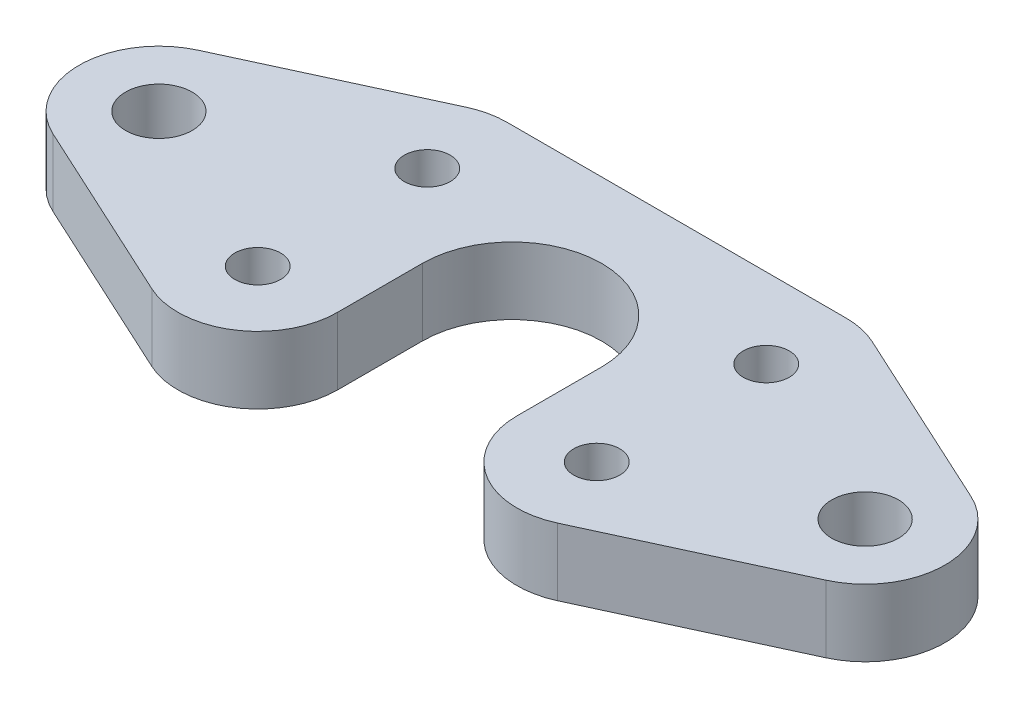
ISO-10303-21;
HEADER;
FILE_DESCRIPTION(('STEP AP214'),'2;1');
FILE_NAME('part.step','',(''),(''),'','','');
FILE_SCHEMA(('AUTOMOTIVE_DESIGN { 1 0 10303 214 1 1 1 1 }'));
ENDSEC;
DATA;
#1=APPLICATION_CONTEXT('core data for automotive mechanical design processes');
#2=APPLICATION_PROTOCOL_DEFINITION('international standard','automotive_design',2000,#1);
#3=PRODUCT_CONTEXT('',#1,'mechanical');
#4=PRODUCT('Part','Part','',(#3));
#5=PRODUCT_RELATED_PRODUCT_CATEGORY('part','',(#4));
#6=PRODUCT_DEFINITION_FORMATION('','',#4);
#7=PRODUCT_DEFINITION_CONTEXT('part definition',#1,'design');
#8=PRODUCT_DEFINITION('design','',#6,#7);
#9=PRODUCT_DEFINITION_SHAPE('','',#8);
#10=(LENGTH_UNIT() NAMED_UNIT(*) SI_UNIT(.MILLI.,.METRE.));
#11=(NAMED_UNIT(*) PLANE_ANGLE_UNIT() SI_UNIT($,.RADIAN.));
#12=(NAMED_UNIT(*) SI_UNIT($,.STERADIAN.) SOLID_ANGLE_UNIT());
#13=UNCERTAINTY_MEASURE_WITH_UNIT(LENGTH_MEASURE(1.E-05),#10,'distance_accuracy_value','');
#14=(GEOMETRIC_REPRESENTATION_CONTEXT(3) GLOBAL_UNCERTAINTY_ASSIGNED_CONTEXT((#13)) GLOBAL_UNIT_ASSIGNED_CONTEXT((#10,
#11,#12)) REPRESENTATION_CONTEXT('',''));
#15=CARTESIAN_POINT('',(0.,0.,0.));
#16=DIRECTION('',(0.,0.,1.));
#17=DIRECTION('',(1.,0.,0.));
#18=AXIS2_PLACEMENT_3D('',#15,#16,#17);
#19=CARTESIAN_POINT('',(0.,4.7625,0.));
#20=DIRECTION('',(0.,1.,0.));
#21=DIRECTION('',(0.,0.,1.));
#22=AXIS2_PLACEMENT_3D('',#19,#20,#21);
#23=PLANE('',#22);
#24=CARTESIAN_POINT('',(-12.,4.7625,-6.));
#25=DIRECTION('',(0.,1.,0.));
#26=DIRECTION('',(0.,0.,1.));
#27=AXIS2_PLACEMENT_3D('',#24,#25,#26);
#28=CIRCLE('',#27,1.625);
#29=CARTESIAN_POINT('',(-12.,4.7625,-4.375));
#30=VERTEX_POINT('',#29);
#31=EDGE_CURVE('E176',#30,#30,#28,.T.);
#32=ORIENTED_EDGE('',*,*,#31,.F.);
#33=EDGE_LOOP('',(#32));
#34=FACE_BOUND('',#33,.T.);
#35=CARTESIAN_POINT('',(0.,4.7625,0.));
#36=DIRECTION('',(0.,-1.,0.));
#37=DIRECTION('',(0.,0.,1.));
#38=AXIS2_PLACEMENT_3D('',#35,#36,#37);
#39=CIRCLE('',#38,6.35);
#40=CARTESIAN_POINT('',(-6.35,4.7625,0.));
#41=VERTEX_POINT('',#40);
#42=CARTESIAN_POINT('',(6.35,4.7625,0.));
#43=VERTEX_POINT('',#42);
#44=EDGE_CURVE('E142',#41,#43,#39,.T.);
#45=ORIENTED_EDGE('',*,*,#44,.T.);
#46=DIRECTION('',(0.,0.,-1.));
#47=VECTOR('',#46,1.);
#48=CARTESIAN_POINT('',(6.35,4.7625,0.));
#49=LINE('',#48,#47);
#50=CARTESIAN_POINT('',(6.35,4.7625,6.));
#51=VERTEX_POINT('',#50);
#52=EDGE_CURVE('E215',#51,#43,#49,.T.);
#53=ORIENTED_EDGE('',*,*,#52,.F.);
#54=CARTESIAN_POINT('',(12.,4.7625,6.));
#55=DIRECTION('',(0.,-1.,0.));
#56=DIRECTION('',(0.,0.,-1.));
#57=AXIS2_PLACEMENT_3D('',#54,#55,#56);
#58=CIRCLE('',#57,5.65);
#59=CARTESIAN_POINT('',(14.3676787026589,4.7625,11.1299705224276));
#60=VERTEX_POINT('',#59);
#61=EDGE_CURVE('E243',#60,#51,#58,.T.);
#62=ORIENTED_EDGE('',*,*,#61,.F.);
#63=DIRECTION('',(-0.907959384500452,0.,0.419058177461747));
#64=VECTOR('',#63,1.);
#65=CARTESIAN_POINT('',(14.3676787026589,4.7625,11.1299705224276));
#66=LINE('',#65,#64);
#67=CARTESIAN_POINT('',(27.3676787026589,4.7625,5.12997052242755));
#68=VERTEX_POINT('',#67);
#69=EDGE_CURVE('E240',#68,#60,#66,.T.);
#70=ORIENTED_EDGE('',*,*,#69,.F.);
#71=CARTESIAN_POINT('',(25.,4.7625,0.));
#72=DIRECTION('',(0.,-1.,0.));
#73=DIRECTION('',(0.,0.,-1.));
#74=AXIS2_PLACEMENT_3D('',#71,#72,#73);
#75=CIRCLE('',#74,5.65);
#76=CARTESIAN_POINT('',(27.3676787026589,4.7625,-5.12997052242755));
#77=VERTEX_POINT('',#76);
#78=EDGE_CURVE('E237',#77,#68,#75,.T.);
#79=ORIENTED_EDGE('',*,*,#78,.F.);
#80=DIRECTION('',(0.907959384500452,0.,0.419058177461747));
#81=VECTOR('',#80,1.);
#82=CARTESIAN_POINT('',(27.3676787026589,4.7625,-5.12997052242755));
#83=LINE('',#82,#81);
#84=CARTESIAN_POINT('',(14.3676787026589,4.7625,-11.1299705224276));
#85=VERTEX_POINT('',#84);
#86=EDGE_CURVE('E234',#85,#77,#83,.T.);
#87=ORIENTED_EDGE('',*,*,#86,.F.);
#88=CARTESIAN_POINT('',(12.,4.7625,-6.));
#89=DIRECTION('',(0.,-1.,0.));
#90=DIRECTION('',(0.,0.,-1.));
#91=AXIS2_PLACEMENT_3D('',#88,#89,#90);
#92=CIRCLE('',#91,5.65);
#93=CARTESIAN_POINT('',(12.,4.7625,-11.65));
#94=VERTEX_POINT('',#93);
#95=EDGE_CURVE('E211',#94,#85,#92,.T.);
#96=ORIENTED_EDGE('',*,*,#95,.F.);
#97=DIRECTION('',(-1.,0.,0.));
#98=VECTOR('',#97,1.);
#99=CARTESIAN_POINT('',(0.,4.7625,-11.65));
#100=LINE('',#99,#98);
#101=CARTESIAN_POINT('',(-12.,4.7625,-11.65));
#102=VERTEX_POINT('',#101);
#103=EDGE_CURVE('E89',#94,#102,#100,.T.);
#104=ORIENTED_EDGE('',*,*,#103,.T.);
#105=CARTESIAN_POINT('',(-12.,4.7625,-6.));
#106=DIRECTION('',(0.,1.,0.));
#107=DIRECTION('',(0.,0.,-1.));
#108=AXIS2_PLACEMENT_3D('',#105,#106,#107);
#109=CIRCLE('',#108,5.65);
#110=CARTESIAN_POINT('',(-14.3676787026589,4.7625,-11.1299705224276));
#111=VERTEX_POINT('',#110);
#112=EDGE_CURVE('E167',#102,#111,#109,.T.);
#113=ORIENTED_EDGE('',*,*,#112,.T.);
#114=DIRECTION('',(-0.907959384500452,0.,0.419058177461747));
#115=VECTOR('',#114,1.);
#116=CARTESIAN_POINT('',(-27.3676787026589,4.7625,-5.12997052242755));
#117=LINE('',#116,#115);
#118=CARTESIAN_POINT('',(-27.3676787026589,4.7625,-5.12997052242755));
#119=VERTEX_POINT('',#118);
#120=EDGE_CURVE('E155',#111,#119,#117,.T.);
#121=ORIENTED_EDGE('',*,*,#120,.T.);
#122=CARTESIAN_POINT('',(-25.,4.7625,0.));
#123=DIRECTION('',(0.,1.,0.));
#124=DIRECTION('',(0.,0.,-1.));
#125=AXIS2_PLACEMENT_3D('',#122,#123,#124);
#126=CIRCLE('',#125,5.65);
#127=CARTESIAN_POINT('',(-27.3676787026589,4.7625,5.12997052242755));
#128=VERTEX_POINT('',#127);
#129=EDGE_CURVE('E109',#119,#128,#126,.T.);
#130=ORIENTED_EDGE('',*,*,#129,.T.);
#131=DIRECTION('',(0.907959384500452,0.,0.419058177461747));
#132=VECTOR('',#131,1.);
#133=CARTESIAN_POINT('',(-14.3676787026589,4.7625,11.1299705224276));
#134=LINE('',#133,#132);
#135=CARTESIAN_POINT('',(-14.3676787026589,4.7625,11.1299705224276));
#136=VERTEX_POINT('',#135);
#137=EDGE_CURVE('E103',#128,#136,#134,.T.);
#138=ORIENTED_EDGE('',*,*,#137,.T.);
#139=CARTESIAN_POINT('',(-12.,4.7625,6.));
#140=DIRECTION('',(0.,1.,0.));
#141=DIRECTION('',(0.,0.,-1.));
#142=AXIS2_PLACEMENT_3D('',#139,#140,#141);
#143=CIRCLE('',#142,5.65);
#144=CARTESIAN_POINT('',(-6.35,4.7625,6.));
#145=VERTEX_POINT('',#144);
#146=EDGE_CURVE('E107',#136,#145,#143,.T.);
#147=ORIENTED_EDGE('',*,*,#146,.T.);
#148=DIRECTION('',(0.,0.,-1.));
#149=VECTOR('',#148,1.);
#150=CARTESIAN_POINT('',(-6.35,4.7625,0.));
#151=LINE('',#150,#149);
#152=EDGE_CURVE('E48',#145,#41,#151,.T.);
#153=ORIENTED_EDGE('',*,*,#152,.T.);
#154=EDGE_LOOP('',(#45,#53,#62,#70,#79,#87,#96,#104,#113,#121,#130,#138,#147,#153));
#155=FACE_BOUND('',#154,.T.);
#156=CARTESIAN_POINT('',(-25.,4.7625,0.));
#157=DIRECTION('',(0.,1.,0.));
#158=DIRECTION('',(0.,0.,1.));
#159=AXIS2_PLACEMENT_3D('',#156,#157,#158);
#160=CIRCLE('',#159,2.36);
#161=CARTESIAN_POINT('',(-25.,4.7625,2.36));
#162=VERTEX_POINT('',#161);
#163=EDGE_CURVE('E131',#162,#162,#160,.T.);
#164=ORIENTED_EDGE('',*,*,#163,.F.);
#165=EDGE_LOOP('',(#164));
#166=FACE_BOUND('',#165,.T.);
#167=CARTESIAN_POINT('',(-12.,4.7625,6.));
#168=DIRECTION('',(0.,1.,0.));
#169=DIRECTION('',(0.,0.,1.));
#170=AXIS2_PLACEMENT_3D('',#167,#168,#169);
#171=CIRCLE('',#170,1.625);
#172=CARTESIAN_POINT('',(-12.,4.7625,7.625));
#173=VERTEX_POINT('',#172);
#174=EDGE_CURVE('E182',#173,#173,#171,.T.);
#175=ORIENTED_EDGE('',*,*,#174,.F.);
#176=EDGE_LOOP('',(#175));
#177=FACE_BOUND('',#176,.T.);
#178=CARTESIAN_POINT('',(12.,4.7625,6.));
#179=DIRECTION('',(0.,-1.,0.));
#180=DIRECTION('',(0.,0.,1.));
#181=AXIS2_PLACEMENT_3D('',#178,#179,#180);
#182=CIRCLE('',#181,1.625);
#183=CARTESIAN_POINT('',(12.,4.7625,7.625));
#184=VERTEX_POINT('',#183);
#185=EDGE_CURVE('E257',#184,#184,#182,.T.);
#186=ORIENTED_EDGE('',*,*,#185,.T.);
#187=EDGE_LOOP('',(#186));
#188=FACE_BOUND('',#187,.T.);
#189=CARTESIAN_POINT('',(12.,4.7625,-6.));
#190=DIRECTION('',(0.,-1.,0.));
#191=DIRECTION('',(0.,0.,1.));
#192=AXIS2_PLACEMENT_3D('',#189,#190,#191);
#193=CIRCLE('',#192,1.625);
#194=CARTESIAN_POINT('',(12.,4.7625,-4.375));
#195=VERTEX_POINT('',#194);
#196=EDGE_CURVE('E251',#195,#195,#193,.T.);
#197=ORIENTED_EDGE('',*,*,#196,.T.);
#198=EDGE_LOOP('',(#197));
#199=FACE_BOUND('',#198,.T.);
#200=CARTESIAN_POINT('',(25.,4.7625,0.));
#201=DIRECTION('',(0.,-1.,0.));
#202=DIRECTION('',(0.,0.,1.));
#203=AXIS2_PLACEMENT_3D('',#200,#201,#202);
#204=CIRCLE('',#203,2.36);
#205=CARTESIAN_POINT('',(25.,4.7625,2.36));
#206=VERTEX_POINT('',#205);
#207=EDGE_CURVE('E231',#206,#206,#204,.T.);
#208=ORIENTED_EDGE('',*,*,#207,.T.);
#209=EDGE_LOOP('',(#208));
#210=FACE_BOUND('',#209,.T.);
#211=ADVANCED_FACE('F31',(#34,#155,#166,#177,#188,#199,#210),#23,.T.);
#212=CARTESIAN_POINT('',(0.,0.,0.));
#213=DIRECTION('',(0.,1.,0.));
#214=DIRECTION('',(0.,0.,1.));
#215=AXIS2_PLACEMENT_3D('',#212,#213,#214);
#216=PLANE('',#215);
#217=CARTESIAN_POINT('',(-12.,0.,-6.));
#218=DIRECTION('',(0.,1.,0.));
#219=DIRECTION('',(0.,0.,1.));
#220=AXIS2_PLACEMENT_3D('',#217,#218,#219);
#221=CIRCLE('',#220,1.625);
#222=CARTESIAN_POINT('',(-12.,0.,-4.375));
#223=VERTEX_POINT('',#222);
#224=EDGE_CURVE('E179',#223,#223,#221,.T.);
#225=ORIENTED_EDGE('',*,*,#224,.T.);
#226=EDGE_LOOP('',(#225));
#227=FACE_BOUND('',#226,.T.);
#228=CARTESIAN_POINT('',(0.,0.,0.));
#229=DIRECTION('',(0.,-1.,0.));
#230=DIRECTION('',(0.,0.,1.));
#231=AXIS2_PLACEMENT_3D('',#228,#229,#230);
#232=CIRCLE('',#231,6.35);
#233=CARTESIAN_POINT('',(-6.35,0.,0.));
#234=VERTEX_POINT('',#233);
#235=CARTESIAN_POINT('',(6.35,0.,0.));
#236=VERTEX_POINT('',#235);
#237=EDGE_CURVE('E127',#234,#236,#232,.T.);
#238=ORIENTED_EDGE('',*,*,#237,.F.);
#239=DIRECTION('',(0.,0.,-1.));
#240=VECTOR('',#239,1.);
#241=CARTESIAN_POINT('',(-6.35,0.,0.));
#242=LINE('',#241,#240);
#243=CARTESIAN_POINT('',(-6.35,0.,6.));
#244=VERTEX_POINT('',#243);
#245=EDGE_CURVE('E81',#244,#234,#242,.T.);
#246=ORIENTED_EDGE('',*,*,#245,.F.);
#247=CARTESIAN_POINT('',(-12.,0.,6.));
#248=DIRECTION('',(0.,1.,0.));
#249=DIRECTION('',(0.,0.,-1.));
#250=AXIS2_PLACEMENT_3D('',#247,#248,#249);
#251=CIRCLE('',#250,5.65);
#252=CARTESIAN_POINT('',(-14.3676787026589,0.,11.1299705224276));
#253=VERTEX_POINT('',#252);
#254=EDGE_CURVE('E75',#253,#244,#251,.T.);
#255=ORIENTED_EDGE('',*,*,#254,.F.);
#256=DIRECTION('',(0.907959384500452,0.,0.419058177461747));
#257=VECTOR('',#256,1.);
#258=CARTESIAN_POINT('',(-14.3676787026589,0.,11.1299705224276));
#259=LINE('',#258,#257);
#260=CARTESIAN_POINT('',(-27.3676787026589,0.,5.12997052242755));
#261=VERTEX_POINT('',#260);
#262=EDGE_CURVE('E117',#261,#253,#259,.T.);
#263=ORIENTED_EDGE('',*,*,#262,.F.);
#264=CARTESIAN_POINT('',(-25.,0.,0.));
#265=DIRECTION('',(0.,1.,0.));
#266=DIRECTION('',(0.,0.,-1.));
#267=AXIS2_PLACEMENT_3D('',#264,#265,#266);
#268=CIRCLE('',#267,5.65);
#269=CARTESIAN_POINT('',(-27.3676787026589,0.,-5.12997052242755));
#270=VERTEX_POINT('',#269);
#271=EDGE_CURVE('E137',#270,#261,#268,.T.);
#272=ORIENTED_EDGE('',*,*,#271,.F.);
#273=DIRECTION('',(-0.907959384500452,0.,0.419058177461747));
#274=VECTOR('',#273,1.);
#275=CARTESIAN_POINT('',(-27.3676787026589,0.,-5.12997052242755));
#276=LINE('',#275,#274);
#277=CARTESIAN_POINT('',(-14.3676787026589,0.,-11.1299705224276));
#278=VERTEX_POINT('',#277);
#279=EDGE_CURVE('E135',#278,#270,#276,.T.);
#280=ORIENTED_EDGE('',*,*,#279,.F.);
#281=CARTESIAN_POINT('',(-12.,0.,-6.));
#282=DIRECTION('',(0.,1.,0.));
#283=DIRECTION('',(0.,0.,-1.));
#284=AXIS2_PLACEMENT_3D('',#281,#282,#283);
#285=CIRCLE('',#284,5.65);
#286=CARTESIAN_POINT('',(-12.,0.,-11.65));
#287=VERTEX_POINT('',#286);
#288=EDGE_CURVE('E133',#287,#278,#285,.T.);
#289=ORIENTED_EDGE('',*,*,#288,.F.);
#290=DIRECTION('',(-1.,0.,0.));
#291=VECTOR('',#290,1.);
#292=CARTESIAN_POINT('',(0.,0.,-11.65));
#293=LINE('',#292,#291);
#294=CARTESIAN_POINT('',(12.,0.,-11.65));
#295=VERTEX_POINT('',#294);
#296=EDGE_CURVE('E130',#295,#287,#293,.T.);
#297=ORIENTED_EDGE('',*,*,#296,.F.);
#298=CARTESIAN_POINT('',(12.,0.,-6.));
#299=DIRECTION('',(0.,-1.,0.));
#300=DIRECTION('',(0.,0.,-1.));
#301=AXIS2_PLACEMENT_3D('',#298,#299,#300);
#302=CIRCLE('',#301,5.65);
#303=CARTESIAN_POINT('',(14.3676787026589,0.,-11.1299705224276));
#304=VERTEX_POINT('',#303);
#305=EDGE_CURVE('E212',#295,#304,#302,.T.);
#306=ORIENTED_EDGE('',*,*,#305,.T.);
#307=DIRECTION('',(0.907959384500452,0.,0.419058177461747));
#308=VECTOR('',#307,1.);
#309=CARTESIAN_POINT('',(27.3676787026589,0.,-5.12997052242755));
#310=LINE('',#309,#308);
#311=CARTESIAN_POINT('',(27.3676787026589,0.,-5.12997052242755));
#312=VERTEX_POINT('',#311);
#313=EDGE_CURVE('E216',#304,#312,#310,.T.);
#314=ORIENTED_EDGE('',*,*,#313,.T.);
#315=CARTESIAN_POINT('',(25.,0.,0.));
#316=DIRECTION('',(0.,-1.,0.));
#317=DIRECTION('',(0.,0.,-1.));
#318=AXIS2_PLACEMENT_3D('',#315,#316,#317);
#319=CIRCLE('',#318,5.65);
#320=CARTESIAN_POINT('',(27.3676787026589,0.,5.12997052242755));
#321=VERTEX_POINT('',#320);
#322=EDGE_CURVE('E219',#312,#321,#319,.T.);
#323=ORIENTED_EDGE('',*,*,#322,.T.);
#324=DIRECTION('',(-0.907959384500452,0.,0.419058177461747));
#325=VECTOR('',#324,1.);
#326=CARTESIAN_POINT('',(14.3676787026589,0.,11.1299705224276));
#327=LINE('',#326,#325);
#328=CARTESIAN_POINT('',(14.3676787026589,0.,11.1299705224276));
#329=VERTEX_POINT('',#328);
#330=EDGE_CURVE('E222',#321,#329,#327,.T.);
#331=ORIENTED_EDGE('',*,*,#330,.T.);
#332=CARTESIAN_POINT('',(12.,0.,6.));
#333=DIRECTION('',(0.,-1.,0.));
#334=DIRECTION('',(0.,0.,-1.));
#335=AXIS2_PLACEMENT_3D('',#332,#333,#334);
#336=CIRCLE('',#335,5.65);
#337=CARTESIAN_POINT('',(6.35,0.,6.));
#338=VERTEX_POINT('',#337);
#339=EDGE_CURVE('E225',#329,#338,#336,.T.);
#340=ORIENTED_EDGE('',*,*,#339,.T.);
#341=DIRECTION('',(0.,0.,-1.));
#342=VECTOR('',#341,1.);
#343=CARTESIAN_POINT('',(6.35,0.,0.));
#344=LINE('',#343,#342);
#345=EDGE_CURVE('E228',#338,#236,#344,.T.);
#346=ORIENTED_EDGE('',*,*,#345,.T.);
#347=EDGE_LOOP('',(#238,#246,#255,#263,#272,#280,#289,#297,#306,#314,#323,#331,#340,#346));
#348=FACE_BOUND('',#347,.T.);
#349=CARTESIAN_POINT('',(-25.,0.,0.));
#350=DIRECTION('',(0.,1.,0.));
#351=DIRECTION('',(0.,0.,1.));
#352=AXIS2_PLACEMENT_3D('',#349,#350,#351);
#353=CIRCLE('',#352,2.36);
#354=CARTESIAN_POINT('',(-25.,0.,2.36));
#355=VERTEX_POINT('',#354);
#356=EDGE_CURVE('E173',#355,#355,#353,.T.);
#357=ORIENTED_EDGE('',*,*,#356,.T.);
#358=EDGE_LOOP('',(#357));
#359=FACE_BOUND('',#358,.T.);
#360=CARTESIAN_POINT('',(-12.,0.,6.));
#361=DIRECTION('',(0.,1.,0.));
#362=DIRECTION('',(0.,0.,1.));
#363=AXIS2_PLACEMENT_3D('',#360,#361,#362);
#364=CIRCLE('',#363,1.625);
#365=CARTESIAN_POINT('',(-12.,0.,7.625));
#366=VERTEX_POINT('',#365);
#367=EDGE_CURVE('E185',#366,#366,#364,.T.);
#368=ORIENTED_EDGE('',*,*,#367,.T.);
#369=EDGE_LOOP('',(#368));
#370=FACE_BOUND('',#369,.T.);
#371=CARTESIAN_POINT('',(12.,0.,6.));
#372=DIRECTION('',(0.,-1.,0.));
#373=DIRECTION('',(0.,0.,1.));
#374=AXIS2_PLACEMENT_3D('',#371,#372,#373);
#375=CIRCLE('',#374,1.625);
#376=CARTESIAN_POINT('',(12.,0.,7.625));
#377=VERTEX_POINT('',#376);
#378=EDGE_CURVE('E260',#377,#377,#375,.T.);
#379=ORIENTED_EDGE('',*,*,#378,.F.);
#380=EDGE_LOOP('',(#379));
#381=FACE_BOUND('',#380,.T.);
#382=CARTESIAN_POINT('',(12.,0.,-6.));
#383=DIRECTION('',(0.,-1.,0.));
#384=DIRECTION('',(0.,0.,1.));
#385=AXIS2_PLACEMENT_3D('',#382,#383,#384);
#386=CIRCLE('',#385,1.625);
#387=CARTESIAN_POINT('',(12.,0.,-4.375));
#388=VERTEX_POINT('',#387);
#389=EDGE_CURVE('E254',#388,#388,#386,.T.);
#390=ORIENTED_EDGE('',*,*,#389,.F.);
#391=EDGE_LOOP('',(#390));
#392=FACE_BOUND('',#391,.T.);
#393=CARTESIAN_POINT('',(25.,0.,0.));
#394=DIRECTION('',(0.,-1.,0.));
#395=DIRECTION('',(0.,0.,1.));
#396=AXIS2_PLACEMENT_3D('',#393,#394,#395);
#397=CIRCLE('',#396,2.36);
#398=CARTESIAN_POINT('',(25.,0.,2.36));
#399=VERTEX_POINT('',#398);
#400=EDGE_CURVE('E248',#399,#399,#397,.T.);
#401=ORIENTED_EDGE('',*,*,#400,.F.);
#402=EDGE_LOOP('',(#401));
#403=FACE_BOUND('',#402,.T.);
#404=ADVANCED_FACE('F162',(#227,#348,#359,#370,#381,#392,#403),#216,.F.);
#405=CARTESIAN_POINT('',(0.,4.7625,0.));
#406=DIRECTION('',(0.,-1.,0.));
#407=DIRECTION('',(0.,0.,-1.));
#408=AXIS2_PLACEMENT_3D('',#405,#406,#407);
#409=CYLINDRICAL_SURFACE('',#408,6.35);
#410=ORIENTED_EDGE('',*,*,#237,.T.);
#411=DIRECTION('',(0.,-1.,0.));
#412=VECTOR('',#411,1.);
#413=CARTESIAN_POINT('',(6.35,4.7625,0.));
#414=LINE('',#413,#412);
#415=EDGE_CURVE('E188',#43,#236,#414,.T.);
#416=ORIENTED_EDGE('',*,*,#415,.F.);
#417=ORIENTED_EDGE('',*,*,#44,.F.);
#418=DIRECTION('',(0.,-1.,0.));
#419=VECTOR('',#418,1.);
#420=CARTESIAN_POINT('',(-6.35,4.7625,0.));
#421=LINE('',#420,#419);
#422=EDGE_CURVE('E123',#41,#234,#421,.T.);
#423=ORIENTED_EDGE('',*,*,#422,.T.);
#424=EDGE_LOOP('',(#410,#416,#417,#423));
#425=FACE_BOUND('',#424,.T.);
#426=ADVANCED_FACE('F33',(#425),#409,.F.);
#427=CARTESIAN_POINT('',(0.,4.7625,-11.65));
#428=DIRECTION('',(0.,0.,1.));
#429=DIRECTION('',(1.,0.,0.));
#430=AXIS2_PLACEMENT_3D('',#427,#428,#429);
#431=PLANE('',#430);
#432=ORIENTED_EDGE('',*,*,#296,.T.);
#433=DIRECTION('',(0.,-1.,0.));
#434=VECTOR('',#433,1.);
#435=CARTESIAN_POINT('',(-12.,4.7625,-11.65));
#436=LINE('',#435,#434);
#437=EDGE_CURVE('E11',#102,#287,#436,.T.);
#438=ORIENTED_EDGE('',*,*,#437,.F.);
#439=ORIENTED_EDGE('',*,*,#103,.F.);
#440=DIRECTION('',(0.,-1.,0.));
#441=VECTOR('',#440,1.);
#442=CARTESIAN_POINT('',(12.,4.7625,-11.65));
#443=LINE('',#442,#441);
#444=EDGE_CURVE('E208',#94,#295,#443,.T.);
#445=ORIENTED_EDGE('',*,*,#444,.T.);
#446=EDGE_LOOP('',(#432,#438,#439,#445));
#447=FACE_BOUND('',#446,.T.);
#448=ADVANCED_FACE('F321',(#447),#431,.F.);
#449=CARTESIAN_POINT('',(-12.,4.7625,-6.));
#450=DIRECTION('',(0.,-1.,0.));
#451=DIRECTION('',(0.,0.,-1.));
#452=AXIS2_PLACEMENT_3D('',#449,#450,#451);
#453=CYLINDRICAL_SURFACE('',#452,5.65);
#454=ORIENTED_EDGE('',*,*,#288,.T.);
#455=DIRECTION('',(0.,-1.,0.));
#456=VECTOR('',#455,1.);
#457=CARTESIAN_POINT('',(-14.3676787026589,4.7625,-11.1299705224276));
#458=LINE('',#457,#456);
#459=EDGE_CURVE('E40',#111,#278,#458,.T.);
#460=ORIENTED_EDGE('',*,*,#459,.F.);
#461=ORIENTED_EDGE('',*,*,#112,.F.);
#462=ORIENTED_EDGE('',*,*,#437,.T.);
#463=EDGE_LOOP('',(#454,#460,#461,#462));
#464=FACE_BOUND('',#463,.T.);
#465=ADVANCED_FACE('F319',(#464),#453,.T.);
#466=CARTESIAN_POINT('',(-27.3676787026589,4.7625,-5.12997052242755));
#467=DIRECTION('',(0.419058177461747,0.,0.907959384500452));
#468=DIRECTION('',(0.907959384500452,0.,-0.419058177461747));
#469=AXIS2_PLACEMENT_3D('',#466,#467,#468);
#470=PLANE('',#469);
#471=ORIENTED_EDGE('',*,*,#279,.T.);
#472=DIRECTION('',(0.,-1.,0.));
#473=VECTOR('',#472,1.);
#474=CARTESIAN_POINT('',(-27.3676787026589,4.7625,-5.12997052242755));
#475=LINE('',#474,#473);
#476=EDGE_CURVE('E146',#119,#270,#475,.T.);
#477=ORIENTED_EDGE('',*,*,#476,.F.);
#478=ORIENTED_EDGE('',*,*,#120,.F.);
#479=ORIENTED_EDGE('',*,*,#459,.T.);
#480=EDGE_LOOP('',(#471,#477,#478,#479));
#481=FACE_BOUND('',#480,.T.);
#482=ADVANCED_FACE('F153',(#481),#470,.F.);
#483=CARTESIAN_POINT('',(-25.,4.7625,0.));
#484=DIRECTION('',(0.,-1.,0.));
#485=DIRECTION('',(0.,0.,-1.));
#486=AXIS2_PLACEMENT_3D('',#483,#484,#485);
#487=CYLINDRICAL_SURFACE('',#486,5.65);
#488=ORIENTED_EDGE('',*,*,#271,.T.);
#489=DIRECTION('',(0.,-1.,0.));
#490=VECTOR('',#489,1.);
#491=CARTESIAN_POINT('',(-27.3676787026589,4.7625,5.12997052242755));
#492=LINE('',#491,#490);
#493=EDGE_CURVE('E118',#128,#261,#492,.T.);
#494=ORIENTED_EDGE('',*,*,#493,.F.);
#495=ORIENTED_EDGE('',*,*,#129,.F.);
#496=ORIENTED_EDGE('',*,*,#476,.T.);
#497=EDGE_LOOP('',(#488,#494,#495,#496));
#498=FACE_BOUND('',#497,.T.);
#499=ADVANCED_FACE('F166',(#498),#487,.T.);
#500=CARTESIAN_POINT('',(-14.3676787026589,4.7625,11.1299705224276));
#501=DIRECTION('',(0.419058177461747,0.,-0.907959384500452));
#502=DIRECTION('',(-0.907959384500452,0.,-0.419058177461747));
#503=AXIS2_PLACEMENT_3D('',#500,#501,#502);
#504=PLANE('',#503);
#505=ORIENTED_EDGE('',*,*,#262,.T.);
#506=DIRECTION('',(0.,-1.,0.));
#507=VECTOR('',#506,1.);
#508=CARTESIAN_POINT('',(-14.3676787026589,4.7625,11.1299705224276));
#509=LINE('',#508,#507);
#510=EDGE_CURVE('E114',#136,#253,#509,.T.);
#511=ORIENTED_EDGE('',*,*,#510,.F.);
#512=ORIENTED_EDGE('',*,*,#137,.F.);
#513=ORIENTED_EDGE('',*,*,#493,.T.);
#514=EDGE_LOOP('',(#505,#511,#512,#513));
#515=FACE_BOUND('',#514,.T.);
#516=ADVANCED_FACE('F115',(#515),#504,.F.);
#517=CARTESIAN_POINT('',(-12.,4.7625,6.));
#518=DIRECTION('',(0.,-1.,0.));
#519=DIRECTION('',(0.,0.,-1.));
#520=AXIS2_PLACEMENT_3D('',#517,#518,#519);
#521=CYLINDRICAL_SURFACE('',#520,5.65);
#522=ORIENTED_EDGE('',*,*,#254,.T.);
#523=DIRECTION('',(0.,-1.,0.));
#524=VECTOR('',#523,1.);
#525=CARTESIAN_POINT('',(-6.35,4.7625,6.));
#526=LINE('',#525,#524);
#527=EDGE_CURVE('E119',#145,#244,#526,.T.);
#528=ORIENTED_EDGE('',*,*,#527,.F.);
#529=ORIENTED_EDGE('',*,*,#146,.F.);
#530=ORIENTED_EDGE('',*,*,#510,.T.);
#531=EDGE_LOOP('',(#522,#528,#529,#530));
#532=FACE_BOUND('',#531,.T.);
#533=ADVANCED_FACE('F121',(#532),#521,.T.);
#534=CARTESIAN_POINT('',(-6.35,4.7625,0.));
#535=DIRECTION('',(-1.,0.,0.));
#536=DIRECTION('',(0.,0.,1.));
#537=AXIS2_PLACEMENT_3D('',#534,#535,#536);
#538=PLANE('',#537);
#539=ORIENTED_EDGE('',*,*,#245,.T.);
#540=ORIENTED_EDGE('',*,*,#422,.F.);
#541=ORIENTED_EDGE('',*,*,#152,.F.);
#542=ORIENTED_EDGE('',*,*,#527,.T.);
#543=EDGE_LOOP('',(#539,#540,#541,#542));
#544=FACE_BOUND('',#543,.T.);
#545=ADVANCED_FACE('F308',(#544),#538,.F.);
#546=CARTESIAN_POINT('',(-25.,4.7625,0.));
#547=DIRECTION('',(0.,-1.,0.));
#548=DIRECTION('',(0.,0.,-1.));
#549=AXIS2_PLACEMENT_3D('',#546,#547,#548);
#550=CYLINDRICAL_SURFACE('',#549,2.36);
#551=ORIENTED_EDGE('',*,*,#163,.T.);
#552=EDGE_LOOP('',(#551));
#553=FACE_BOUND('',#552,.T.);
#554=ORIENTED_EDGE('',*,*,#356,.F.);
#555=EDGE_LOOP('',(#554));
#556=FACE_BOUND('',#555,.T.);
#557=ADVANCED_FACE('F305',(#553,#556),#550,.F.);
#558=CARTESIAN_POINT('',(-12.,4.7625,-6.));
#559=DIRECTION('',(0.,-1.,0.));
#560=DIRECTION('',(0.,0.,-1.));
#561=AXIS2_PLACEMENT_3D('',#558,#559,#560);
#562=CYLINDRICAL_SURFACE('',#561,1.625);
#563=ORIENTED_EDGE('',*,*,#31,.T.);
#564=EDGE_LOOP('',(#563));
#565=FACE_BOUND('',#564,.T.);
#566=ORIENTED_EDGE('',*,*,#224,.F.);
#567=EDGE_LOOP('',(#566));
#568=FACE_BOUND('',#567,.T.);
#569=ADVANCED_FACE('F395',(#565,#568),#562,.F.);
#570=CARTESIAN_POINT('',(-12.,4.7625,6.));
#571=DIRECTION('',(0.,-1.,0.));
#572=DIRECTION('',(0.,0.,-1.));
#573=AXIS2_PLACEMENT_3D('',#570,#571,#572);
#574=CYLINDRICAL_SURFACE('',#573,1.625);
#575=ORIENTED_EDGE('',*,*,#174,.T.);
#576=EDGE_LOOP('',(#575));
#577=FACE_BOUND('',#576,.T.);
#578=ORIENTED_EDGE('',*,*,#367,.F.);
#579=EDGE_LOOP('',(#578));
#580=FACE_BOUND('',#579,.T.);
#581=ADVANCED_FACE('F393',(#577,#580),#574,.F.);
#582=CARTESIAN_POINT('',(6.35,4.7625,0.));
#583=DIRECTION('',(-1.,0.,0.));
#584=DIRECTION('',(0.,0.,1.));
#585=AXIS2_PLACEMENT_3D('',#582,#583,#584);
#586=PLANE('',#585);
#587=ORIENTED_EDGE('',*,*,#345,.F.);
#588=DIRECTION('',(0.,-1.,0.));
#589=VECTOR('',#588,1.);
#590=CARTESIAN_POINT('',(6.35,4.7625,6.));
#591=LINE('',#590,#589);
#592=EDGE_CURVE('E193',#51,#338,#591,.T.);
#593=ORIENTED_EDGE('',*,*,#592,.F.);
#594=ORIENTED_EDGE('',*,*,#52,.T.);
#595=ORIENTED_EDGE('',*,*,#415,.T.);
#596=EDGE_LOOP('',(#587,#593,#594,#595));
#597=FACE_BOUND('',#596,.T.);
#598=ADVANCED_FACE('F363',(#597),#586,.T.);
#599=CARTESIAN_POINT('',(12.,4.7625,6.));
#600=DIRECTION('',(0.,-1.,0.));
#601=DIRECTION('',(0.,0.,-1.));
#602=AXIS2_PLACEMENT_3D('',#599,#600,#601);
#603=CYLINDRICAL_SURFACE('',#602,5.65);
#604=ORIENTED_EDGE('',*,*,#339,.F.);
#605=DIRECTION('',(0.,-1.,0.));
#606=VECTOR('',#605,1.);
#607=CARTESIAN_POINT('',(14.3676787026589,4.7625,11.1299705224276));
#608=LINE('',#607,#606);
#609=EDGE_CURVE('E196',#60,#329,#608,.T.);
#610=ORIENTED_EDGE('',*,*,#609,.F.);
#611=ORIENTED_EDGE('',*,*,#61,.T.);
#612=ORIENTED_EDGE('',*,*,#592,.T.);
#613=EDGE_LOOP('',(#604,#610,#611,#612));
#614=FACE_BOUND('',#613,.T.);
#615=ADVANCED_FACE('F370',(#614),#603,.T.);
#616=CARTESIAN_POINT('',(14.3676787026589,4.7625,11.1299705224276));
#617=DIRECTION('',(0.419058177461747,0.,0.907959384500452));
#618=DIRECTION('',(0.907959384500452,0.,-0.419058177461747));
#619=AXIS2_PLACEMENT_3D('',#616,#617,#618);
#620=PLANE('',#619);
#621=ORIENTED_EDGE('',*,*,#330,.F.);
#622=DIRECTION('',(0.,-1.,0.));
#623=VECTOR('',#622,1.);
#624=CARTESIAN_POINT('',(27.3676787026589,4.7625,5.12997052242755));
#625=LINE('',#624,#623);
#626=EDGE_CURVE('E199',#68,#321,#625,.T.);
#627=ORIENTED_EDGE('',*,*,#626,.F.);
#628=ORIENTED_EDGE('',*,*,#69,.T.);
#629=ORIENTED_EDGE('',*,*,#609,.T.);
#630=EDGE_LOOP('',(#621,#627,#628,#629));
#631=FACE_BOUND('',#630,.T.);
#632=ADVANCED_FACE('F373',(#631),#620,.T.);
#633=CARTESIAN_POINT('',(25.,4.7625,0.));
#634=DIRECTION('',(0.,-1.,0.));
#635=DIRECTION('',(0.,0.,-1.));
#636=AXIS2_PLACEMENT_3D('',#633,#634,#635);
#637=CYLINDRICAL_SURFACE('',#636,5.65);
#638=ORIENTED_EDGE('',*,*,#322,.F.);
#639=DIRECTION('',(0.,-1.,0.));
#640=VECTOR('',#639,1.);
#641=CARTESIAN_POINT('',(27.3676787026589,4.7625,-5.12997052242755));
#642=LINE('',#641,#640);
#643=EDGE_CURVE('E202',#77,#312,#642,.T.);
#644=ORIENTED_EDGE('',*,*,#643,.F.);
#645=ORIENTED_EDGE('',*,*,#78,.T.);
#646=ORIENTED_EDGE('',*,*,#626,.T.);
#647=EDGE_LOOP('',(#638,#644,#645,#646));
#648=FACE_BOUND('',#647,.T.);
#649=ADVANCED_FACE('F378',(#648),#637,.T.);
#650=CARTESIAN_POINT('',(27.3676787026589,4.7625,-5.12997052242755));
#651=DIRECTION('',(0.419058177461747,0.,-0.907959384500452));
#652=DIRECTION('',(-0.907959384500452,0.,-0.419058177461747));
#653=AXIS2_PLACEMENT_3D('',#650,#651,#652);
#654=PLANE('',#653);
#655=ORIENTED_EDGE('',*,*,#313,.F.);
#656=DIRECTION('',(0.,-1.,0.));
#657=VECTOR('',#656,1.);
#658=CARTESIAN_POINT('',(14.3676787026589,4.7625,-11.1299705224276));
#659=LINE('',#658,#657);
#660=EDGE_CURVE('E205',#85,#304,#659,.T.);
#661=ORIENTED_EDGE('',*,*,#660,.F.);
#662=ORIENTED_EDGE('',*,*,#86,.T.);
#663=ORIENTED_EDGE('',*,*,#643,.T.);
#664=EDGE_LOOP('',(#655,#661,#662,#663));
#665=FACE_BOUND('',#664,.T.);
#666=ADVANCED_FACE('F294',(#665),#654,.T.);
#667=CARTESIAN_POINT('',(12.,4.7625,-6.));
#668=DIRECTION('',(0.,-1.,0.));
#669=DIRECTION('',(0.,0.,-1.));
#670=AXIS2_PLACEMENT_3D('',#667,#668,#669);
#671=CYLINDRICAL_SURFACE('',#670,5.65);
#672=ORIENTED_EDGE('',*,*,#305,.F.);
#673=ORIENTED_EDGE('',*,*,#444,.F.);
#674=ORIENTED_EDGE('',*,*,#95,.T.);
#675=ORIENTED_EDGE('',*,*,#660,.T.);
#676=EDGE_LOOP('',(#672,#673,#674,#675));
#677=FACE_BOUND('',#676,.T.);
#678=ADVANCED_FACE('F285',(#677),#671,.T.);
#679=CARTESIAN_POINT('',(25.,4.7625,0.));
#680=DIRECTION('',(0.,-1.,0.));
#681=DIRECTION('',(0.,0.,-1.));
#682=AXIS2_PLACEMENT_3D('',#679,#680,#681);
#683=CYLINDRICAL_SURFACE('',#682,2.36);
#684=ORIENTED_EDGE('',*,*,#207,.F.);
#685=EDGE_LOOP('',(#684));
#686=FACE_BOUND('',#685,.T.);
#687=ORIENTED_EDGE('',*,*,#400,.T.);
#688=EDGE_LOOP('',(#687));
#689=FACE_BOUND('',#688,.T.);
#690=ADVANCED_FACE('F283',(#686,#689),#683,.F.);
#691=CARTESIAN_POINT('',(12.,4.7625,-6.));
#692=DIRECTION('',(0.,-1.,0.));
#693=DIRECTION('',(0.,0.,-1.));
#694=AXIS2_PLACEMENT_3D('',#691,#692,#693);
#695=CYLINDRICAL_SURFACE('',#694,1.625);
#696=ORIENTED_EDGE('',*,*,#196,.F.);
#697=EDGE_LOOP('',(#696));
#698=FACE_BOUND('',#697,.T.);
#699=ORIENTED_EDGE('',*,*,#389,.T.);
#700=EDGE_LOOP('',(#699));
#701=FACE_BOUND('',#700,.T.);
#702=ADVANCED_FACE('F271',(#698,#701),#695,.F.);
#703=CARTESIAN_POINT('',(12.,4.7625,6.));
#704=DIRECTION('',(0.,-1.,0.));
#705=DIRECTION('',(0.,0.,-1.));
#706=AXIS2_PLACEMENT_3D('',#703,#704,#705);
#707=CYLINDRICAL_SURFACE('',#706,1.625);
#708=ORIENTED_EDGE('',*,*,#185,.F.);
#709=EDGE_LOOP('',(#708));
#710=FACE_BOUND('',#709,.T.);
#711=ORIENTED_EDGE('',*,*,#378,.T.);
#712=EDGE_LOOP('',(#711));
#713=FACE_BOUND('',#712,.T.);
#714=ADVANCED_FACE('F268',(#710,#713),#707,.F.);
#715=CLOSED_SHELL('',(#211,#404,#426,#448,#465,#482,#499,#516,#533,#545,#557,#569,#581,#598,
#615,#632,#649,#666,#678,#690,#702,#714));
#716=MANIFOLD_SOLID_BREP('B2',#715);
#717=ADVANCED_BREP_SHAPE_REPRESENTATION('',(#18,#716),#14);
#718=SHAPE_DEFINITION_REPRESENTATION(#9,#717);
ENDSEC;
END-ISO-10303-21;
